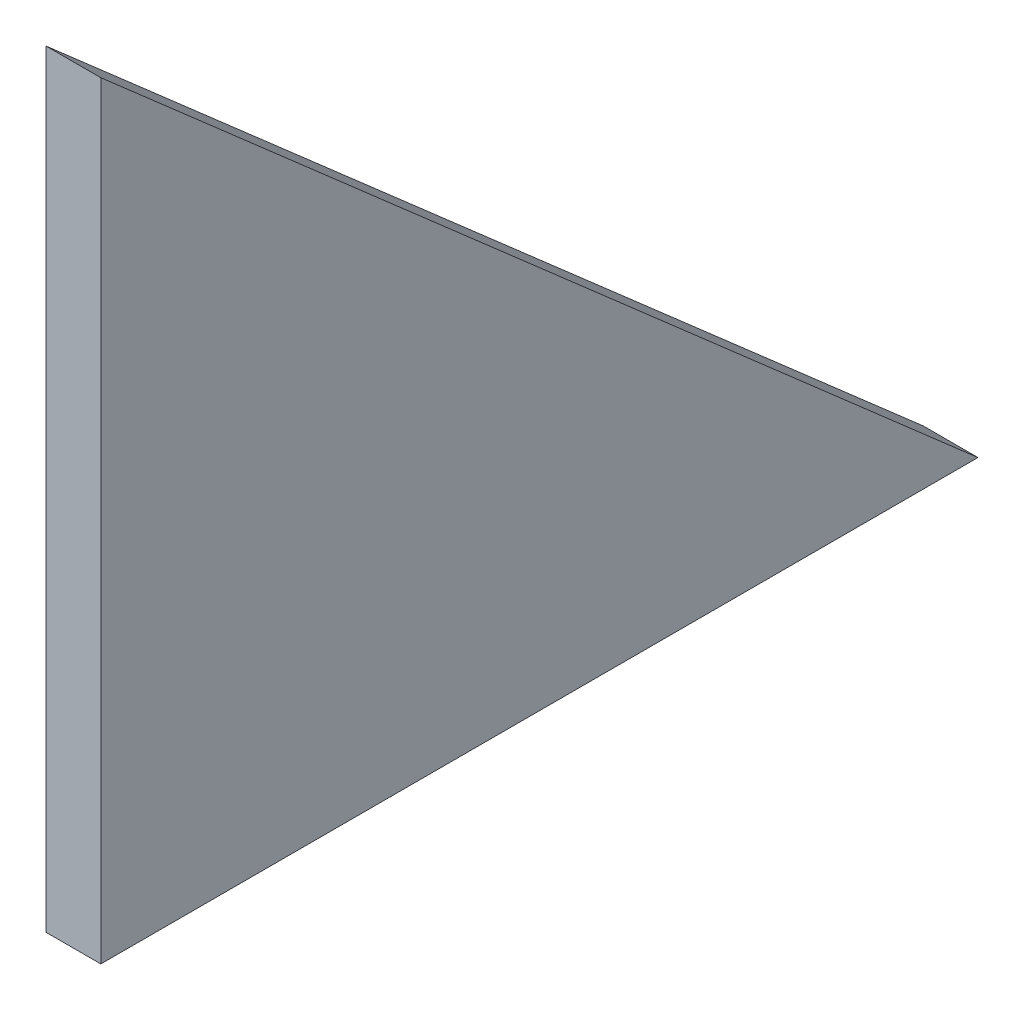
ISO-10303-21;
HEADER;
FILE_DESCRIPTION(('STEP AP214'),'2;1');
FILE_NAME('part.step','',(''),(''),'','','');
FILE_SCHEMA(('AUTOMOTIVE_DESIGN { 1 0 10303 214 1 1 1 1 }'));
ENDSEC;
DATA;
#1=APPLICATION_CONTEXT('core data for automotive mechanical design processes');
#2=APPLICATION_PROTOCOL_DEFINITION('international standard','automotive_design',2000,#1);
#3=PRODUCT_CONTEXT('',#1,'mechanical');
#4=PRODUCT('Part','Part','',(#3));
#5=PRODUCT_RELATED_PRODUCT_CATEGORY('part','',(#4));
#6=PRODUCT_DEFINITION_FORMATION('','',#4);
#7=PRODUCT_DEFINITION_CONTEXT('part definition',#1,'design');
#8=PRODUCT_DEFINITION('design','',#6,#7);
#9=PRODUCT_DEFINITION_SHAPE('','',#8);
#10=(LENGTH_UNIT() NAMED_UNIT(*) SI_UNIT(.MILLI.,.METRE.));
#11=(NAMED_UNIT(*) PLANE_ANGLE_UNIT() SI_UNIT($,.RADIAN.));
#12=(NAMED_UNIT(*) SI_UNIT($,.STERADIAN.) SOLID_ANGLE_UNIT());
#13=UNCERTAINTY_MEASURE_WITH_UNIT(LENGTH_MEASURE(1.E-05),#10,'distance_accuracy_value','');
#14=(GEOMETRIC_REPRESENTATION_CONTEXT(3) GLOBAL_UNCERTAINTY_ASSIGNED_CONTEXT((#13)) GLOBAL_UNIT_ASSIGNED_CONTEXT((#10,
#11,#12)) REPRESENTATION_CONTEXT('',''));
#15=CARTESIAN_POINT('',(0.,0.,0.));
#16=DIRECTION('',(0.,0.,1.));
#17=DIRECTION('',(1.,0.,0.));
#18=AXIS2_PLACEMENT_3D('',#15,#16,#17);
#19=CARTESIAN_POINT('',(5.,0.,-80.));
#20=DIRECTION('',(0.,1.,0.));
#21=DIRECTION('',(0.,0.,1.));
#22=AXIS2_PLACEMENT_3D('',#19,#20,#21);
#23=PLANE('',#22);
#24=DIRECTION('',(0.,0.,-1.));
#25=VECTOR('',#24,1.);
#26=CARTESIAN_POINT('',(0.,0.,-80.));
#27=LINE('',#26,#25);
#28=CARTESIAN_POINT('',(0.,0.,0.));
#29=VERTEX_POINT('',#28);
#30=CARTESIAN_POINT('',(0.,0.,-80.));
#31=VERTEX_POINT('',#30);
#32=EDGE_CURVE('E80',#29,#31,#27,.T.);
#33=ORIENTED_EDGE('',*,*,#32,.T.);
#34=DIRECTION('',(-1.,0.,0.));
#35=VECTOR('',#34,1.);
#36=CARTESIAN_POINT('',(5.,0.,-80.));
#37=LINE('',#36,#35);
#38=CARTESIAN_POINT('',(5.,0.,-80.));
#39=VERTEX_POINT('',#38);
#40=EDGE_CURVE('E11',#39,#31,#37,.T.);
#41=ORIENTED_EDGE('',*,*,#40,.F.);
#42=DIRECTION('',(0.,0.,-1.));
#43=VECTOR('',#42,1.);
#44=CARTESIAN_POINT('',(5.,0.,-80.));
#45=LINE('',#44,#43);
#46=CARTESIAN_POINT('',(5.,0.,0.));
#47=VERTEX_POINT('',#46);
#48=EDGE_CURVE('E73',#47,#39,#45,.T.);
#49=ORIENTED_EDGE('',*,*,#48,.F.);
#50=DIRECTION('',(-1.,0.,0.));
#51=VECTOR('',#50,1.);
#52=CARTESIAN_POINT('',(5.,0.,0.));
#53=LINE('',#52,#51);
#54=EDGE_CURVE('E81',#47,#29,#53,.T.);
#55=ORIENTED_EDGE('',*,*,#54,.T.);
#56=EDGE_LOOP('',(#33,#41,#49,#55));
#57=FACE_BOUND('',#56,.T.);
#58=ADVANCED_FACE('F33',(#57),#23,.F.);
#59=CARTESIAN_POINT('',(5.,70.,0.));
#60=DIRECTION('',(0.,-0.752576694706878,0.658504607868518));
#61=DIRECTION('',(0.,-0.658504607868518,-0.752576694706878));
#62=AXIS2_PLACEMENT_3D('',#59,#60,#61);
#63=PLANE('',#62);
#64=DIRECTION('',(0.,0.658504607868518,0.752576694706878));
#65=VECTOR('',#64,1.);
#66=CARTESIAN_POINT('',(0.,70.,0.));
#67=LINE('',#66,#65);
#68=CARTESIAN_POINT('',(0.,70.,0.));
#69=VERTEX_POINT('',#68);
#70=EDGE_CURVE('E61',#31,#69,#67,.T.);
#71=ORIENTED_EDGE('',*,*,#70,.T.);
#72=DIRECTION('',(-1.,0.,0.));
#73=VECTOR('',#72,1.);
#74=CARTESIAN_POINT('',(5.,70.,0.));
#75=LINE('',#74,#73);
#76=CARTESIAN_POINT('',(5.,70.,0.));
#77=VERTEX_POINT('',#76);
#78=EDGE_CURVE('E41',#77,#69,#75,.T.);
#79=ORIENTED_EDGE('',*,*,#78,.F.);
#80=DIRECTION('',(0.,0.658504607868518,0.752576694706878));
#81=VECTOR('',#80,1.);
#82=CARTESIAN_POINT('',(5.,70.,0.));
#83=LINE('',#82,#81);
#84=EDGE_CURVE('E69',#39,#77,#83,.T.);
#85=ORIENTED_EDGE('',*,*,#84,.F.);
#86=ORIENTED_EDGE('',*,*,#40,.T.);
#87=EDGE_LOOP('',(#71,#79,#85,#86));
#88=FACE_BOUND('',#87,.T.);
#89=ADVANCED_FACE('F70',(#88),#63,.F.);
#90=CARTESIAN_POINT('',(5.,0.,0.));
#91=DIRECTION('',(0.,0.,-1.));
#92=DIRECTION('',(-1.,0.,0.));
#93=AXIS2_PLACEMENT_3D('',#90,#91,#92);
#94=PLANE('',#93);
#95=DIRECTION('',(0.,-1.,0.));
#96=VECTOR('',#95,1.);
#97=CARTESIAN_POINT('',(0.,0.,0.));
#98=LINE('',#97,#96);
#99=EDGE_CURVE('E66',#69,#29,#98,.T.);
#100=ORIENTED_EDGE('',*,*,#99,.T.);
#101=ORIENTED_EDGE('',*,*,#54,.F.);
#102=DIRECTION('',(0.,-1.,0.));
#103=VECTOR('',#102,1.);
#104=CARTESIAN_POINT('',(5.,0.,0.));
#105=LINE('',#104,#103);
#106=EDGE_CURVE('E49',#77,#47,#105,.T.);
#107=ORIENTED_EDGE('',*,*,#106,.F.);
#108=ORIENTED_EDGE('',*,*,#78,.T.);
#109=EDGE_LOOP('',(#100,#101,#107,#108));
#110=FACE_BOUND('',#109,.T.);
#111=ADVANCED_FACE('F88',(#110),#94,.F.);
#112=CARTESIAN_POINT('',(5.,0.,0.));
#113=DIRECTION('',(-1.,0.,0.));
#114=DIRECTION('',(0.,0.,1.));
#115=AXIS2_PLACEMENT_3D('',#112,#113,#114);
#116=PLANE('',#115);
#117=ORIENTED_EDGE('',*,*,#48,.T.);
#118=ORIENTED_EDGE('',*,*,#84,.T.);
#119=ORIENTED_EDGE('',*,*,#106,.T.);
#120=EDGE_LOOP('',(#117,#118,#119));
#121=FACE_BOUND('',#120,.T.);
#122=ADVANCED_FACE('F76',(#121),#116,.F.);
#123=CARTESIAN_POINT('',(0.,0.,0.));
#124=DIRECTION('',(-1.,0.,0.));
#125=DIRECTION('',(0.,0.,1.));
#126=AXIS2_PLACEMENT_3D('',#123,#124,#125);
#127=PLANE('',#126);
#128=ORIENTED_EDGE('',*,*,#32,.F.);
#129=ORIENTED_EDGE('',*,*,#99,.F.);
#130=ORIENTED_EDGE('',*,*,#70,.F.);
#131=EDGE_LOOP('',(#128,#129,#130));
#132=FACE_BOUND('',#131,.T.);
#133=ADVANCED_FACE('F89',(#132),#127,.T.);
#134=CLOSED_SHELL('',(#58,#89,#111,#122,#133));
#135=MANIFOLD_SOLID_BREP('B2',#134);
#136=ADVANCED_BREP_SHAPE_REPRESENTATION('',(#18,#135),#14);
#137=SHAPE_DEFINITION_REPRESENTATION(#9,#136);
ENDSEC;
END-ISO-10303-21;
